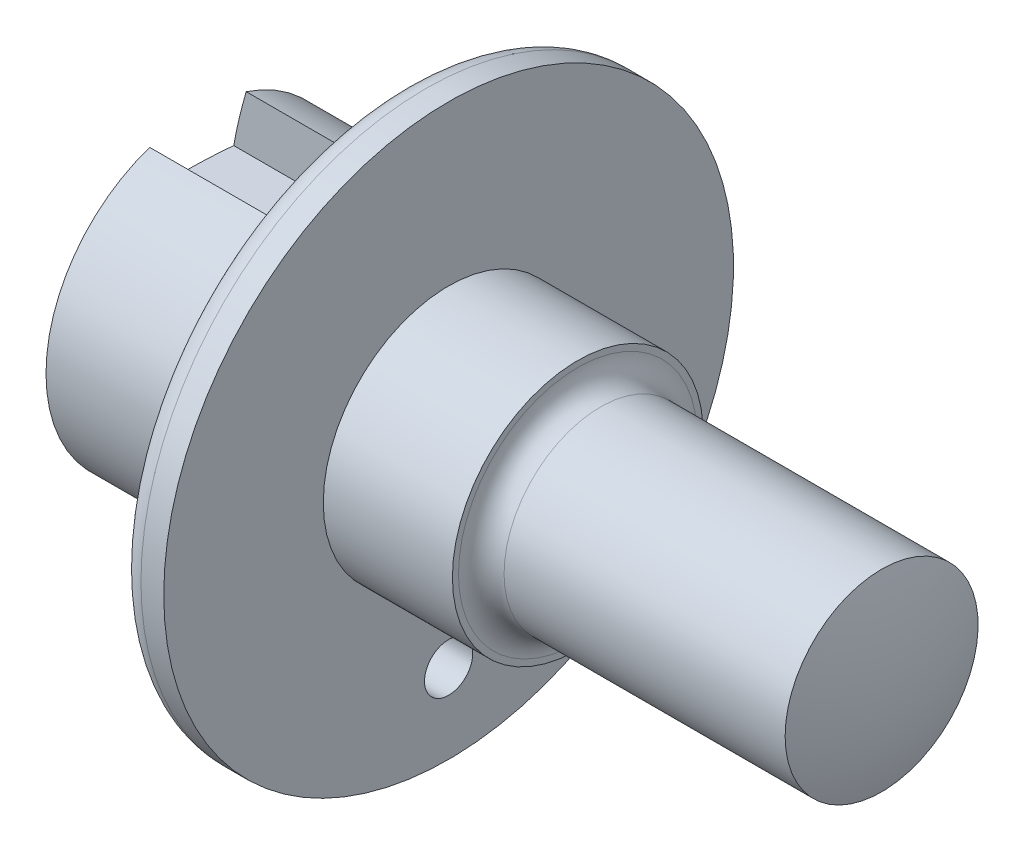
ISO-10303-21;
HEADER;
FILE_DESCRIPTION(('STEP AP214'),'2;1');
FILE_NAME('part.step','',(''),(''),'','','');
FILE_SCHEMA(('AUTOMOTIVE_DESIGN { 1 0 10303 214 1 1 1 1 }'));
ENDSEC;
DATA;
#1=APPLICATION_CONTEXT('core data for automotive mechanical design processes');
#2=APPLICATION_PROTOCOL_DEFINITION('international standard','automotive_design',2000,#1);
#3=PRODUCT_CONTEXT('',#1,'mechanical');
#4=PRODUCT('Part','Part','',(#3));
#5=PRODUCT_RELATED_PRODUCT_CATEGORY('part','',(#4));
#6=PRODUCT_DEFINITION_FORMATION('','',#4);
#7=PRODUCT_DEFINITION_CONTEXT('part definition',#1,'design');
#8=PRODUCT_DEFINITION('design','',#6,#7);
#9=PRODUCT_DEFINITION_SHAPE('','',#8);
#10=(LENGTH_UNIT() NAMED_UNIT(*) SI_UNIT(.MILLI.,.METRE.));
#11=(NAMED_UNIT(*) PLANE_ANGLE_UNIT() SI_UNIT($,.RADIAN.));
#12=(NAMED_UNIT(*) SI_UNIT($,.STERADIAN.) SOLID_ANGLE_UNIT());
#13=UNCERTAINTY_MEASURE_WITH_UNIT(LENGTH_MEASURE(1.E-05),#10,'distance_accuracy_value','');
#14=(GEOMETRIC_REPRESENTATION_CONTEXT(3) GLOBAL_UNCERTAINTY_ASSIGNED_CONTEXT((#13)) GLOBAL_UNIT_ASSIGNED_CONTEXT((#10,
#11,#12)) REPRESENTATION_CONTEXT('',''));
#15=CARTESIAN_POINT('',(0.,0.,0.));
#16=DIRECTION('',(0.,0.,1.));
#17=DIRECTION('',(1.,0.,0.));
#18=AXIS2_PLACEMENT_3D('',#15,#16,#17);
#19=CARTESIAN_POINT('',(20.6666666666665,0.,0.));
#20=DIRECTION('',(-1.,0.,0.));
#21=DIRECTION('',(0.,1.,0.));
#22=AXIS2_PLACEMENT_3D('',#19,#20,#21);
#23=SPHERICAL_SURFACE('',#22,68.1666666666665);
#24=CARTESIAN_POINT('',(-44.5,0.,0.));
#25=DIRECTION('',(-1.,0.,0.));
#26=DIRECTION('',(0.,0.,1.));
#27=AXIS2_PLACEMENT_3D('',#24,#25,#26);
#28=CIRCLE('',#27,20.);
#29=CARTESIAN_POINT('',(-44.5,18.9651654356085,-6.35000000000001));
#30=VERTEX_POINT('',#29);
#31=CARTESIAN_POINT('',(-44.5,18.9651654356085,6.35));
#32=VERTEX_POINT('',#31);
#33=EDGE_CURVE('E119',#30,#32,#28,.T.);
#34=ORIENTED_EDGE('',*,*,#33,.T.);
#35=CARTESIAN_POINT('',(20.6666666666665,0.,6.35));
#36=DIRECTION('',(0.,0.,1.));
#37=DIRECTION('',(1.,0.,0.));
#38=AXIS2_PLACEMENT_3D('',#35,#36,#37);
#39=CIRCLE('',#38,67.870258172814);
#40=CARTESIAN_POINT('',(-46.1343209341499,12.,6.35));
#41=VERTEX_POINT('',#40);
#42=EDGE_CURVE('E54',#32,#41,#39,.T.);
#43=ORIENTED_EDGE('',*,*,#42,.T.);
#44=CARTESIAN_POINT('',(20.6666666666665,12.,0.));
#45=DIRECTION('',(0.,-1.,0.));
#46=DIRECTION('',(0.,0.,-1.));
#47=AXIS2_PLACEMENT_3D('',#44,#45,#46);
#48=CIRCLE('',#47,67.1021195227426);
#49=CARTESIAN_POINT('',(-46.1343209341499,12.,-6.35000000000001));
#50=VERTEX_POINT('',#49);
#51=EDGE_CURVE('E11',#41,#50,#48,.T.);
#52=ORIENTED_EDGE('',*,*,#51,.T.);
#53=CARTESIAN_POINT('',(20.6666666666665,0.,-6.35000000000001));
#54=DIRECTION('',(0.,0.,-1.));
#55=DIRECTION('',(-1.,0.,0.));
#56=AXIS2_PLACEMENT_3D('',#53,#54,#55);
#57=CIRCLE('',#56,67.870258172814);
#58=EDGE_CURVE('E87',#50,#30,#57,.T.);
#59=ORIENTED_EDGE('',*,*,#58,.T.);
#60=EDGE_LOOP('',(#34,#43,#52,#59));
#61=FACE_BOUND('',#60,.T.);
#62=ADVANCED_FACE('F31',(#61),#23,.T.);
#63=CARTESIAN_POINT('',(-47.5,0.,0.));
#64=DIRECTION('',(-1.,0.,0.));
#65=DIRECTION('',(0.,0.,1.));
#66=AXIS2_PLACEMENT_3D('',#63,#64,#65);
#67=CYLINDRICAL_SURFACE('',#66,20.);
#68=CARTESIAN_POINT('',(-27.5,0.,0.));
#69=DIRECTION('',(-1.,0.,0.));
#70=DIRECTION('',(0.,0.,1.));
#71=AXIS2_PLACEMENT_3D('',#68,#69,#70);
#72=CIRCLE('',#71,20.);
#73=CARTESIAN_POINT('',(-27.5,18.9651654356085,6.35));
#74=VERTEX_POINT('',#73);
#75=CARTESIAN_POINT('',(-27.5,18.9651654356085,-6.35000000000001));
#76=VERTEX_POINT('',#75);
#77=EDGE_CURVE('E79',#74,#76,#72,.T.);
#78=ORIENTED_EDGE('',*,*,#77,.F.);
#79=DIRECTION('',(-1.,0.,0.));
#80=VECTOR('',#79,1.);
#81=CARTESIAN_POINT('',(-47.5,18.9651654356085,6.35));
#82=LINE('',#81,#80);
#83=EDGE_CURVE('E40',#74,#32,#82,.T.);
#84=ORIENTED_EDGE('',*,*,#83,.T.);
#85=ORIENTED_EDGE('',*,*,#33,.F.);
#86=DIRECTION('',(-1.,0.,0.));
#87=VECTOR('',#86,1.);
#88=CARTESIAN_POINT('',(-47.5,18.9651654356085,-6.35000000000001));
#89=LINE('',#88,#87);
#90=EDGE_CURVE('E129',#30,#76,#89,.F.);
#91=ORIENTED_EDGE('',*,*,#90,.T.);
#92=EDGE_LOOP('',(#78,#84,#85,#91));
#93=FACE_BOUND('',#92,.T.);
#94=CARTESIAN_POINT('',(-17.5,0.,0.));
#95=DIRECTION('',(-1.,0.,0.));
#96=DIRECTION('',(0.,0.,1.));
#97=AXIS2_PLACEMENT_3D('',#94,#95,#96);
#98=CIRCLE('',#97,20.);
#99=CARTESIAN_POINT('',(-17.5,0.,20.));
#100=VERTEX_POINT('',#99);
#101=EDGE_CURVE('E116',#100,#100,#98,.T.);
#102=ORIENTED_EDGE('',*,*,#101,.T.);
#103=EDGE_LOOP('',(#102));
#104=FACE_BOUND('',#103,.T.);
#105=ADVANCED_FACE('F133',(#93,#104),#67,.T.);
#106=CARTESIAN_POINT('',(-17.5,37.5,0.));
#107=DIRECTION('',(1.,0.,0.));
#108=DIRECTION('',(0.,0.,-1.));
#109=AXIS2_PLACEMENT_3D('',#106,#107,#108);
#110=PLANE('',#109);
#111=CARTESIAN_POINT('',(-17.5,-27.,0.));
#112=DIRECTION('',(-1.,0.,0.));
#113=DIRECTION('',(0.,0.,1.));
#114=AXIS2_PLACEMENT_3D('',#111,#112,#113);
#115=CIRCLE('',#114,3.175);
#116=CARTESIAN_POINT('',(-17.5,-27.,3.175));
#117=VERTEX_POINT('',#116);
#118=EDGE_CURVE('E138',#117,#117,#115,.T.);
#119=ORIENTED_EDGE('',*,*,#118,.F.);
#120=EDGE_LOOP('',(#119));
#121=FACE_BOUND('',#120,.T.);
#122=CARTESIAN_POINT('',(-17.5,0.,0.));
#123=DIRECTION('',(1.,0.,0.));
#124=DIRECTION('',(0.,0.,-1.));
#125=AXIS2_PLACEMENT_3D('',#122,#123,#124);
#126=CIRCLE('',#125,34.5);
#127=CARTESIAN_POINT('',(-17.5,0.,-34.5));
#128=VERTEX_POINT('',#127);
#129=EDGE_CURVE('E122',#128,#128,#126,.F.);
#130=ORIENTED_EDGE('',*,*,#129,.T.);
#131=EDGE_LOOP('',(#130));
#132=FACE_BOUND('',#131,.T.);
#133=ORIENTED_EDGE('',*,*,#101,.F.);
#134=EDGE_LOOP('',(#133));
#135=FACE_BOUND('',#134,.T.);
#136=ADVANCED_FACE('F146',(#121,#132,#135),#110,.F.);
#137=CARTESIAN_POINT('',(-47.5,0.,0.));
#138=DIRECTION('',(-1.,0.,0.));
#139=DIRECTION('',(0.,0.,1.));
#140=AXIS2_PLACEMENT_3D('',#137,#138,#139);
#141=CYLINDRICAL_SURFACE('',#140,37.5);
#142=CARTESIAN_POINT('',(-14.5,0.,0.));
#143=DIRECTION('',(1.,0.,0.));
#144=DIRECTION('',(0.,0.,-1.));
#145=AXIS2_PLACEMENT_3D('',#142,#143,#144);
#146=CIRCLE('',#145,37.5);
#147=CARTESIAN_POINT('',(-14.5,0.,-37.5));
#148=VERTEX_POINT('',#147);
#149=EDGE_CURVE('E125',#148,#148,#146,.T.);
#150=ORIENTED_EDGE('',*,*,#149,.T.);
#151=EDGE_LOOP('',(#150));
#152=FACE_BOUND('',#151,.T.);
#153=CARTESIAN_POINT('',(-11.5,0.,0.));
#154=DIRECTION('',(-1.,0.,0.));
#155=DIRECTION('',(0.,0.,1.));
#156=AXIS2_PLACEMENT_3D('',#153,#154,#155);
#157=CIRCLE('',#156,37.5);
#158=CARTESIAN_POINT('',(-11.5,0.,37.5));
#159=VERTEX_POINT('',#158);
#160=EDGE_CURVE('E113',#159,#159,#157,.T.);
#161=ORIENTED_EDGE('',*,*,#160,.T.);
#162=EDGE_LOOP('',(#161));
#163=FACE_BOUND('',#162,.T.);
#164=ADVANCED_FACE('F149',(#152,#163),#141,.T.);
#165=CARTESIAN_POINT('',(-11.5,16.5,0.));
#166=DIRECTION('',(-1.,0.,0.));
#167=DIRECTION('',(0.,0.,1.));
#168=AXIS2_PLACEMENT_3D('',#165,#166,#167);
#169=PLANE('',#168);
#170=CARTESIAN_POINT('',(-11.5,-27.,0.));
#171=DIRECTION('',(-1.,0.,0.));
#172=DIRECTION('',(0.,0.,1.));
#173=AXIS2_PLACEMENT_3D('',#170,#171,#172);
#174=CIRCLE('',#173,3.175);
#175=CARTESIAN_POINT('',(-11.5,-27.,3.175));
#176=VERTEX_POINT('',#175);
#177=EDGE_CURVE('E35',#176,#176,#174,.T.);
#178=ORIENTED_EDGE('',*,*,#177,.T.);
#179=EDGE_LOOP('',(#178));
#180=FACE_BOUND('',#179,.T.);
#181=ORIENTED_EDGE('',*,*,#160,.F.);
#182=EDGE_LOOP('',(#181));
#183=FACE_BOUND('',#182,.T.);
#184=CARTESIAN_POINT('',(-11.5,0.,0.));
#185=DIRECTION('',(-1.,0.,0.));
#186=DIRECTION('',(0.,0.,1.));
#187=AXIS2_PLACEMENT_3D('',#184,#185,#186);
#188=CIRCLE('',#187,16.5);
#189=CARTESIAN_POINT('',(-11.5,0.,16.5));
#190=VERTEX_POINT('',#189);
#191=EDGE_CURVE('E110',#190,#190,#188,.T.);
#192=ORIENTED_EDGE('',*,*,#191,.T.);
#193=EDGE_LOOP('',(#192));
#194=FACE_BOUND('',#193,.T.);
#195=ADVANCED_FACE('F163',(#180,#183,#194),#169,.F.);
#196=CARTESIAN_POINT('',(-47.5,0.,0.));
#197=DIRECTION('',(-1.,0.,0.));
#198=DIRECTION('',(0.,0.,1.));
#199=AXIS2_PLACEMENT_3D('',#196,#197,#198);
#200=CYLINDRICAL_SURFACE('',#199,16.5);
#201=ORIENTED_EDGE('',*,*,#191,.F.);
#202=EDGE_LOOP('',(#201));
#203=FACE_BOUND('',#202,.T.);
#204=CARTESIAN_POINT('',(5.5,0.,0.));
#205=DIRECTION('',(-1.,0.,0.));
#206=DIRECTION('',(0.,0.,1.));
#207=AXIS2_PLACEMENT_3D('',#204,#205,#206);
#208=CIRCLE('',#207,16.5);
#209=CARTESIAN_POINT('',(5.5,0.,16.5));
#210=VERTEX_POINT('',#209);
#211=EDGE_CURVE('E107',#210,#210,#208,.T.);
#212=ORIENTED_EDGE('',*,*,#211,.T.);
#213=EDGE_LOOP('',(#212));
#214=FACE_BOUND('',#213,.T.);
#215=ADVANCED_FACE('F167',(#203,#214),#200,.T.);
#216=CARTESIAN_POINT('',(5.5,15.7,0.));
#217=DIRECTION('',(-1.,0.,0.));
#218=DIRECTION('',(0.,0.,1.));
#219=AXIS2_PLACEMENT_3D('',#216,#217,#218);
#220=PLANE('',#219);
#221=ORIENTED_EDGE('',*,*,#211,.F.);
#222=EDGE_LOOP('',(#221));
#223=FACE_BOUND('',#222,.T.);
#224=CARTESIAN_POINT('',(5.50000000000001,0.,0.));
#225=DIRECTION('',(-1.,0.,0.));
#226=DIRECTION('',(0.,0.,1.));
#227=AXIS2_PLACEMENT_3D('',#224,#225,#226);
#228=CIRCLE('',#227,15.7);
#229=CARTESIAN_POINT('',(5.50000000000001,0.,15.7));
#230=VERTEX_POINT('',#229);
#231=EDGE_CURVE('E104',#230,#230,#228,.T.);
#232=ORIENTED_EDGE('',*,*,#231,.T.);
#233=EDGE_LOOP('',(#232));
#234=FACE_BOUND('',#233,.T.);
#235=ADVANCED_FACE('F171',(#223,#234),#220,.F.);
#236=CARTESIAN_POINT('',(8.50000000000001,0.,0.));
#237=DIRECTION('',(-1.,0.,0.));
#238=DIRECTION('',(0.,0.,1.));
#239=AXIS2_PLACEMENT_3D('',#236,#237,#238);
#240=TOROIDAL_SURFACE('',#239,15.7,3.);
#241=ORIENTED_EDGE('',*,*,#231,.F.);
#242=EDGE_LOOP('',(#241));
#243=FACE_BOUND('',#242,.T.);
#244=CARTESIAN_POINT('',(8.50000000000001,0.,0.));
#245=DIRECTION('',(-1.,0.,0.));
#246=DIRECTION('',(0.,0.,1.));
#247=AXIS2_PLACEMENT_3D('',#244,#245,#246);
#248=CIRCLE('',#247,12.7);
#249=CARTESIAN_POINT('',(8.50000000000001,0.,12.7));
#250=VERTEX_POINT('',#249);
#251=EDGE_CURVE('E101',#250,#250,#248,.T.);
#252=ORIENTED_EDGE('',*,*,#251,.T.);
#253=EDGE_LOOP('',(#252));
#254=FACE_BOUND('',#253,.T.);
#255=ADVANCED_FACE('F175',(#243,#254),#240,.F.);
#256=CARTESIAN_POINT('',(-47.5,0.,0.));
#257=DIRECTION('',(-1.,0.,0.));
#258=DIRECTION('',(0.,0.,1.));
#259=AXIS2_PLACEMENT_3D('',#256,#257,#258);
#260=CYLINDRICAL_SURFACE('',#259,12.7);
#261=ORIENTED_EDGE('',*,*,#251,.F.);
#262=EDGE_LOOP('',(#261));
#263=FACE_BOUND('',#262,.T.);
#264=CARTESIAN_POINT('',(45.5,0.,0.));
#265=DIRECTION('',(-1.,0.,0.));
#266=DIRECTION('',(0.,0.,1.));
#267=AXIS2_PLACEMENT_3D('',#264,#265,#266);
#268=CIRCLE('',#267,12.7);
#269=CARTESIAN_POINT('',(45.5,0.,12.7));
#270=VERTEX_POINT('',#269);
#271=EDGE_CURVE('E98',#270,#270,#268,.T.);
#272=ORIENTED_EDGE('',*,*,#271,.T.);
#273=EDGE_LOOP('',(#272));
#274=FACE_BOUND('',#273,.T.);
#275=ADVANCED_FACE('F179',(#263,#274),#260,.T.);
#276=CARTESIAN_POINT('',(6.17749999999962,0.,0.));
#277=DIRECTION('',(-1.,0.,0.));
#278=DIRECTION('',(0.,1.,0.));
#279=AXIS2_PLACEMENT_3D('',#276,#277,#278);
#280=SPHERICAL_SURFACE('',#279,41.3225000000004);
#281=ORIENTED_EDGE('',*,*,#271,.F.);
#282=EDGE_LOOP('',(#281));
#283=FACE_BOUND('',#282,.T.);
#284=ADVANCED_FACE('F183',(#283),#280,.T.);
#285=CARTESIAN_POINT('',(-14.5,0.,0.));
#286=DIRECTION('',(1.,0.,0.));
#287=DIRECTION('',(0.,0.,-1.));
#288=AXIS2_PLACEMENT_3D('',#285,#286,#287);
#289=TOROIDAL_SURFACE('',#288,34.5,3.);
#290=ORIENTED_EDGE('',*,*,#149,.F.);
#291=EDGE_LOOP('',(#290));
#292=FACE_BOUND('',#291,.T.);
#293=ORIENTED_EDGE('',*,*,#129,.F.);
#294=EDGE_LOOP('',(#293));
#295=FACE_BOUND('',#294,.T.);
#296=ADVANCED_FACE('F33',(#292,#295),#289,.T.);
#297=CARTESIAN_POINT('',(-27.5,12.,-6.35000000000001));
#298=DIRECTION('',(0.,-1.,0.));
#299=DIRECTION('',(0.,0.,-1.));
#300=AXIS2_PLACEMENT_3D('',#297,#298,#299);
#301=PLANE('',#300);
#302=DIRECTION('',(-1.,0.,0.));
#303=VECTOR('',#302,1.);
#304=CARTESIAN_POINT('',(-27.5,12.,6.35));
#305=LINE('',#304,#303);
#306=CARTESIAN_POINT('',(-27.5,12.,6.35));
#307=VERTEX_POINT('',#306);
#308=EDGE_CURVE('E89',#307,#41,#305,.T.);
#309=ORIENTED_EDGE('',*,*,#308,.F.);
#310=DIRECTION('',(0.,0.,1.));
#311=VECTOR('',#310,1.);
#312=CARTESIAN_POINT('',(-27.5,12.,-6.35000000000001));
#313=LINE('',#312,#311);
#314=CARTESIAN_POINT('',(-27.5,12.,-6.35000000000001));
#315=VERTEX_POINT('',#314);
#316=EDGE_CURVE('E77',#315,#307,#313,.T.);
#317=ORIENTED_EDGE('',*,*,#316,.F.);
#318=DIRECTION('',(-1.,0.,0.));
#319=VECTOR('',#318,1.);
#320=CARTESIAN_POINT('',(-27.5,12.,-6.35000000000001));
#321=LINE('',#320,#319);
#322=EDGE_CURVE('E84',#315,#50,#321,.T.);
#323=ORIENTED_EDGE('',*,*,#322,.T.);
#324=ORIENTED_EDGE('',*,*,#51,.F.);
#325=EDGE_LOOP('',(#309,#317,#323,#324));
#326=FACE_BOUND('',#325,.T.);
#327=ADVANCED_FACE('F91',(#326),#301,.F.);
#328=CARTESIAN_POINT('',(-27.5,28.,6.35));
#329=DIRECTION('',(0.,0.,1.));
#330=DIRECTION('',(1.,0.,0.));
#331=AXIS2_PLACEMENT_3D('',#328,#329,#330);
#332=PLANE('',#331);
#333=ORIENTED_EDGE('',*,*,#83,.F.);
#334=DIRECTION('',(0.,1.,0.));
#335=VECTOR('',#334,1.);
#336=CARTESIAN_POINT('',(-27.5,28.,6.35));
#337=LINE('',#336,#335);
#338=EDGE_CURVE('E47',#307,#74,#337,.T.);
#339=ORIENTED_EDGE('',*,*,#338,.F.);
#340=ORIENTED_EDGE('',*,*,#308,.T.);
#341=ORIENTED_EDGE('',*,*,#42,.F.);
#342=EDGE_LOOP('',(#333,#339,#340,#341));
#343=FACE_BOUND('',#342,.T.);
#344=ADVANCED_FACE('F136',(#343),#332,.F.);
#345=CARTESIAN_POINT('',(-27.5,28.,-6.35000000000001));
#346=DIRECTION('',(0.,0.,-1.));
#347=DIRECTION('',(-1.,0.,0.));
#348=AXIS2_PLACEMENT_3D('',#345,#346,#347);
#349=PLANE('',#348);
#350=ORIENTED_EDGE('',*,*,#322,.F.);
#351=DIRECTION('',(0.,-1.,0.));
#352=VECTOR('',#351,1.);
#353=CARTESIAN_POINT('',(-27.5,28.,-6.35000000000001));
#354=LINE('',#353,#352);
#355=EDGE_CURVE('E73',#76,#315,#354,.T.);
#356=ORIENTED_EDGE('',*,*,#355,.F.);
#357=ORIENTED_EDGE('',*,*,#90,.F.);
#358=ORIENTED_EDGE('',*,*,#58,.F.);
#359=EDGE_LOOP('',(#350,#356,#357,#358));
#360=FACE_BOUND('',#359,.T.);
#361=ADVANCED_FACE('F85',(#360),#349,.F.);
#362=CARTESIAN_POINT('',(-27.5,12.,6.34999999999999));
#363=DIRECTION('',(-1.,0.,0.));
#364=DIRECTION('',(0.,0.,1.));
#365=AXIS2_PLACEMENT_3D('',#362,#363,#364);
#366=PLANE('',#365);
#367=ORIENTED_EDGE('',*,*,#77,.T.);
#368=ORIENTED_EDGE('',*,*,#355,.T.);
#369=ORIENTED_EDGE('',*,*,#316,.T.);
#370=ORIENTED_EDGE('',*,*,#338,.T.);
#371=EDGE_LOOP('',(#367,#368,#369,#370));
#372=FACE_BOUND('',#371,.T.);
#373=ADVANCED_FACE('F75',(#372),#366,.T.);
#374=CARTESIAN_POINT('',(2.5,-27.,0.));
#375=DIRECTION('',(-1.,0.,0.));
#376=DIRECTION('',(0.,0.,1.));
#377=AXIS2_PLACEMENT_3D('',#374,#375,#376);
#378=CYLINDRICAL_SURFACE('',#377,3.175);
#379=ORIENTED_EDGE('',*,*,#118,.T.);
#380=EDGE_LOOP('',(#379));
#381=FACE_BOUND('',#380,.T.);
#382=ORIENTED_EDGE('',*,*,#177,.F.);
#383=EDGE_LOOP('',(#382));
#384=FACE_BOUND('',#383,.T.);
#385=ADVANCED_FACE('F143',(#381,#384),#378,.F.);
#386=CLOSED_SHELL('',(#62,#105,#136,#164,#195,#215,#235,#255,#275,#284,#296,#327,#344,#361,#373,#385));
#387=MANIFOLD_SOLID_BREP('B2',#386);
#388=ADVANCED_BREP_SHAPE_REPRESENTATION('',(#18,#387),#14);
#389=SHAPE_DEFINITION_REPRESENTATION(#9,#388);
ENDSEC;
END-ISO-10303-21;
